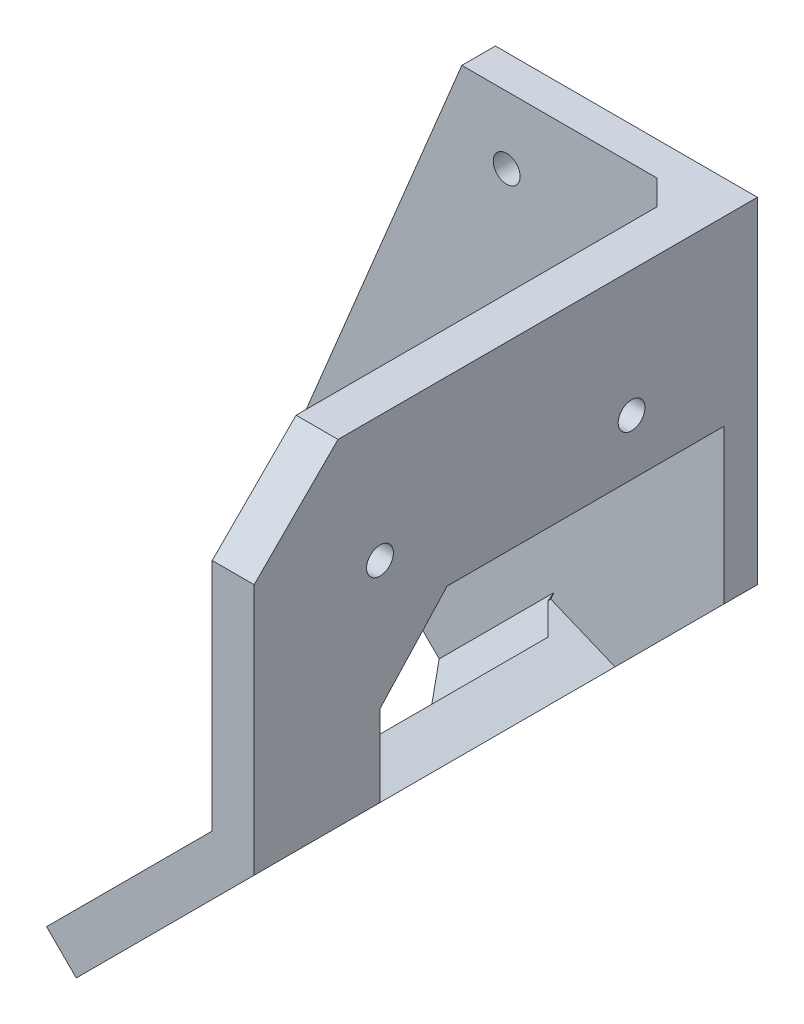
ISO-10303-21;
HEADER;
FILE_DESCRIPTION(('STEP AP214'),'2;1');
FILE_NAME('part.step','',(''),(''),'','','');
FILE_SCHEMA(('AUTOMOTIVE_DESIGN { 1 0 10303 214 1 1 1 1 }'));
ENDSEC;
DATA;
#1=APPLICATION_CONTEXT('core data for automotive mechanical design processes');
#2=APPLICATION_PROTOCOL_DEFINITION('international standard','automotive_design',2000,#1);
#3=PRODUCT_CONTEXT('',#1,'mechanical');
#4=PRODUCT('Part','Part','',(#3));
#5=PRODUCT_RELATED_PRODUCT_CATEGORY('part','',(#4));
#6=PRODUCT_DEFINITION_FORMATION('','',#4);
#7=PRODUCT_DEFINITION_CONTEXT('part definition',#1,'design');
#8=PRODUCT_DEFINITION('design','',#6,#7);
#9=PRODUCT_DEFINITION_SHAPE('','',#8);
#10=(LENGTH_UNIT() NAMED_UNIT(*) SI_UNIT(.MILLI.,.METRE.));
#11=(NAMED_UNIT(*) PLANE_ANGLE_UNIT() SI_UNIT($,.RADIAN.));
#12=(NAMED_UNIT(*) SI_UNIT($,.STERADIAN.) SOLID_ANGLE_UNIT());
#13=UNCERTAINTY_MEASURE_WITH_UNIT(LENGTH_MEASURE(1.E-05),#10,'distance_accuracy_value','');
#14=(GEOMETRIC_REPRESENTATION_CONTEXT(3) GLOBAL_UNCERTAINTY_ASSIGNED_CONTEXT((#13)) GLOBAL_UNIT_ASSIGNED_CONTEXT((#10,
#11,#12)) REPRESENTATION_CONTEXT('',''));
#15=CARTESIAN_POINT('',(0.,0.,0.));
#16=DIRECTION('',(0.,0.,1.));
#17=DIRECTION('',(1.,0.,0.));
#18=AXIS2_PLACEMENT_3D('',#15,#16,#17);
#19=CARTESIAN_POINT('',(196.715728752538,-203.284271247462,60.));
#20=DIRECTION('',(-0.707106781186552,0.707106781186543,0.));
#21=DIRECTION('',(-0.707106781186543,-0.707106781186552,0.));
#22=AXIS2_PLACEMENT_3D('',#19,#20,#21);
#23=PLANE('',#22);
#24=CARTESIAN_POINT('',(207.322330470336,-192.677669529663,15.));
#25=DIRECTION('',(0.707106781186551,-0.707106781186544,0.));
#26=DIRECTION('',(0.707106781186544,0.707106781186551,0.));
#27=AXIS2_PLACEMENT_3D('',#24,#25,#26);
#28=CIRCLE('',#27,1.6);
#29=CARTESIAN_POINT('',(208.453701320235,-191.546298679765,15.));
#30=VERTEX_POINT('',#29);
#31=EDGE_CURVE('E238',#30,#30,#28,.T.);
#32=ORIENTED_EDGE('',*,*,#31,.F.);
#33=EDGE_LOOP('',(#32));
#34=FACE_BOUND('',#33,.T.);
#35=CARTESIAN_POINT('',(207.322330470336,-192.677669529663,45.));
#36=DIRECTION('',(0.707106781186551,-0.707106781186544,0.));
#37=DIRECTION('',(0.707106781186544,0.707106781186551,0.));
#38=AXIS2_PLACEMENT_3D('',#35,#36,#37);
#39=CIRCLE('',#38,1.6);
#40=CARTESIAN_POINT('',(208.453701320235,-191.546298679765,45.));
#41=VERTEX_POINT('',#40);
#42=EDGE_CURVE('E239',#41,#41,#39,.T.);
#43=ORIENTED_EDGE('',*,*,#42,.F.);
#44=EDGE_LOOP('',(#43));
#45=FACE_BOUND('',#44,.T.);
#46=DIRECTION('',(-0.707106781186543,-0.707106781186552,0.));
#47=VECTOR('',#46,1.);
#48=CARTESIAN_POINT('',(196.715728752538,-203.284271247462,45.));
#49=LINE('',#48,#47);
#50=CARTESIAN_POINT('',(225.,-174.999999999999,45.));
#51=VERTEX_POINT('',#50);
#52=CARTESIAN_POINT('',(218.146000964983,-181.853999035016,45.));
#53=VERTEX_POINT('',#52);
#54=EDGE_CURVE('E234',#51,#53,#49,.T.);
#55=ORIENTED_EDGE('',*,*,#54,.F.);
#56=DIRECTION('',(0.,0.,-1.));
#57=VECTOR('',#56,1.);
#58=CARTESIAN_POINT('',(225.,-174.999999999999,60.));
#59=LINE('',#58,#57);
#60=CARTESIAN_POINT('',(225.,-174.999999999999,60.));
#61=VERTEX_POINT('',#60);
#62=EDGE_CURVE('E323',#61,#51,#59,.T.);
#63=ORIENTED_EDGE('',*,*,#62,.F.);
#64=DIRECTION('',(0.707106781186543,0.707106781186552,0.));
#65=VECTOR('',#64,1.);
#66=CARTESIAN_POINT('',(196.715728752538,-203.284271247462,60.));
#67=LINE('',#66,#65);
#68=CARTESIAN_POINT('',(203.786796564404,-196.213203435596,60.));
#69=VERTEX_POINT('',#68);
#70=EDGE_CURVE('E290',#69,#61,#67,.T.);
#71=ORIENTED_EDGE('',*,*,#70,.F.);
#72=DIRECTION('',(-0.499999999999997,-0.500000000000003,-0.707106781186548));
#73=VECTOR('',#72,1.);
#74=CARTESIAN_POINT('',(203.786796564403,-196.213203435596,59.9999999999997));
#75=LINE('',#74,#73);
#76=CARTESIAN_POINT('',(196.715728752538,-203.284271247462,50.));
#77=VERTEX_POINT('',#76);
#78=EDGE_CURVE('E359',#69,#77,#75,.T.);
#79=ORIENTED_EDGE('',*,*,#78,.T.);
#80=DIRECTION('',(0.,0.,-1.));
#81=VECTOR('',#80,1.);
#82=CARTESIAN_POINT('',(196.715728752538,-203.284271247462,60.));
#83=LINE('',#82,#81);
#84=CARTESIAN_POINT('',(196.715728752538,-203.284271247462,0.));
#85=VERTEX_POINT('',#84);
#86=EDGE_CURVE('E301',#77,#85,#83,.T.);
#87=ORIENTED_EDGE('',*,*,#86,.T.);
#88=DIRECTION('',(0.707106781186543,0.707106781186552,0.));
#89=VECTOR('',#88,1.);
#90=CARTESIAN_POINT('',(196.715728752538,-203.284271247462,0.));
#91=LINE('',#90,#89);
#92=CARTESIAN_POINT('',(225.,-174.999999999999,0.));
#93=VERTEX_POINT('',#92);
#94=EDGE_CURVE('E287',#85,#93,#91,.T.);
#95=ORIENTED_EDGE('',*,*,#94,.T.);
#96=CARTESIAN_POINT('',(225.,-174.999999999999,4.));
#97=VERTEX_POINT('',#96);
#98=EDGE_CURVE('E322',#97,#93,#59,.T.);
#99=ORIENTED_EDGE('',*,*,#98,.F.);
#100=DIRECTION('',(0.707106781186543,0.707106781186552,0.));
#101=VECTOR('',#100,1.);
#102=CARTESIAN_POINT('',(196.715728752538,-203.284271247462,4.));
#103=LINE('',#102,#101);
#104=CARTESIAN_POINT('',(212.023066047142,-187.976933952858,4.));
#105=VERTEX_POINT('',#104);
#106=EDGE_CURVE('E50',#105,#97,#103,.T.);
#107=ORIENTED_EDGE('',*,*,#106,.F.);
#108=DIRECTION('',(0.,0.,-1.));
#109=VECTOR('',#108,1.);
#110=CARTESIAN_POINT('',(212.023066047142,-187.976933952858,60.));
#111=LINE('',#110,#109);
#112=CARTESIAN_POINT('',(212.023066047142,-187.976933952858,37.));
#113=VERTEX_POINT('',#112);
#114=EDGE_CURVE('E184',#113,#105,#111,.T.);
#115=ORIENTED_EDGE('',*,*,#114,.F.);
#116=DIRECTION('',(-0.51937668737614,-0.519376687376146,-0.67859834454585));
#117=VECTOR('',#116,1.);
#118=CARTESIAN_POINT('',(211.870999643252,-188.129000356748,36.8013156684757));
#119=LINE('',#118,#117);
#120=EDGE_CURVE('E228',#53,#113,#119,.T.);
#121=ORIENTED_EDGE('',*,*,#120,.F.);
#122=EDGE_LOOP('',(#55,#63,#71,#79,#87,#95,#99,#107,#115,#121));
#123=FACE_BOUND('',#122,.T.);
#124=ADVANCED_FACE('F35',(#34,#45,#123),#23,.F.);
#125=CARTESIAN_POINT('',(225.,-174.999999999999,60.));
#126=DIRECTION('',(-1.,0.,0.));
#127=DIRECTION('',(0.,0.,1.));
#128=AXIS2_PLACEMENT_3D('',#125,#126,#127);
#129=PLANE('',#128);
#130=CARTESIAN_POINT('',(225.,-150.,15.));
#131=DIRECTION('',(1.,0.,0.));
#132=DIRECTION('',(0.,0.,-1.));
#133=AXIS2_PLACEMENT_3D('',#130,#131,#132);
#134=CIRCLE('',#133,1.6);
#135=CARTESIAN_POINT('',(225.,-150.,13.4));
#136=VERTEX_POINT('',#135);
#137=EDGE_CURVE('E249',#136,#136,#134,.T.);
#138=ORIENTED_EDGE('',*,*,#137,.F.);
#139=EDGE_LOOP('',(#138));
#140=FACE_BOUND('',#139,.T.);
#141=CARTESIAN_POINT('',(225.,-149.999999999999,45.));
#142=DIRECTION('',(1.,0.,0.));
#143=DIRECTION('',(0.,0.,-1.));
#144=AXIS2_PLACEMENT_3D('',#141,#142,#143);
#145=CIRCLE('',#144,1.6);
#146=CARTESIAN_POINT('',(225.,-149.999999999999,43.4));
#147=VERTEX_POINT('',#146);
#148=EDGE_CURVE('E245',#147,#147,#145,.T.);
#149=ORIENTED_EDGE('',*,*,#148,.F.);
#150=EDGE_LOOP('',(#149));
#151=FACE_BOUND('',#150,.T.);
#152=DIRECTION('',(0.,-1.,0.));
#153=VECTOR('',#152,1.);
#154=CARTESIAN_POINT('',(225.,-174.999999999999,45.));
#155=LINE('',#154,#153);
#156=CARTESIAN_POINT('',(225.,-165.306981608187,45.));
#157=VERTEX_POINT('',#156);
#158=EDGE_CURVE('E232',#157,#51,#155,.T.);
#159=ORIENTED_EDGE('',*,*,#158,.F.);
#160=DIRECTION('',(0.,-0.734509555267757,0.678598344545845));
#161=VECTOR('',#160,1.);
#162=CARTESIAN_POINT('',(225.,-178.012961106271,56.7387943987878));
#163=LINE('',#162,#161);
#164=CARTESIAN_POINT('',(225.,-156.647844005847,37.));
#165=VERTEX_POINT('',#164);
#166=EDGE_CURVE('E236',#165,#157,#163,.T.);
#167=ORIENTED_EDGE('',*,*,#166,.F.);
#168=DIRECTION('',(0.,0.,1.));
#169=VECTOR('',#168,1.);
#170=CARTESIAN_POINT('',(225.,-156.647844005847,60.));
#171=LINE('',#170,#169);
#172=CARTESIAN_POINT('',(225.,-156.647844005847,4.));
#173=VERTEX_POINT('',#172);
#174=EDGE_CURVE('E226',#173,#165,#171,.T.);
#175=ORIENTED_EDGE('',*,*,#174,.F.);
#176=DIRECTION('',(0.,1.,0.));
#177=VECTOR('',#176,1.);
#178=CARTESIAN_POINT('',(225.,-174.999999999999,4.));
#179=LINE('',#178,#177);
#180=EDGE_CURVE('E218',#97,#173,#179,.T.);
#181=ORIENTED_EDGE('',*,*,#180,.F.);
#182=ORIENTED_EDGE('',*,*,#98,.T.);
#183=DIRECTION('',(0.,1.,0.));
#184=VECTOR('',#183,1.);
#185=CARTESIAN_POINT('',(225.,-174.999999999999,0.));
#186=LINE('',#185,#184);
#187=CARTESIAN_POINT('',(225.,-134.999999999999,0.));
#188=VERTEX_POINT('',#187);
#189=EDGE_CURVE('E304',#93,#188,#186,.T.);
#190=ORIENTED_EDGE('',*,*,#189,.T.);
#191=DIRECTION('',(0.,0.,-1.));
#192=VECTOR('',#191,1.);
#193=CARTESIAN_POINT('',(225.,-134.999999999999,60.));
#194=LINE('',#193,#192);
#195=CARTESIAN_POINT('',(225.,-134.999999999999,50.));
#196=VERTEX_POINT('',#195);
#197=EDGE_CURVE('E320',#196,#188,#194,.T.);
#198=ORIENTED_EDGE('',*,*,#197,.F.);
#199=DIRECTION('',(0.,-0.707106781186547,0.707106781186548));
#200=VECTOR('',#199,1.);
#201=CARTESIAN_POINT('',(225.,-144.999999999999,60.));
#202=LINE('',#201,#200);
#203=CARTESIAN_POINT('',(225.,-144.999999999999,60.));
#204=VERTEX_POINT('',#203);
#205=EDGE_CURVE('E357',#196,#204,#202,.T.);
#206=ORIENTED_EDGE('',*,*,#205,.T.);
#207=DIRECTION('',(0.,1.,0.));
#208=VECTOR('',#207,1.);
#209=CARTESIAN_POINT('',(225.,-174.999999999999,60.));
#210=LINE('',#209,#208);
#211=EDGE_CURVE('E292',#61,#204,#210,.T.);
#212=ORIENTED_EDGE('',*,*,#211,.F.);
#213=ORIENTED_EDGE('',*,*,#62,.T.);
#214=EDGE_LOOP('',(#159,#167,#175,#181,#182,#190,#198,#206,#212,#213));
#215=FACE_BOUND('',#214,.T.);
#216=ADVANCED_FACE('F412',(#140,#151,#215),#129,.F.);
#217=CARTESIAN_POINT('',(220.,-134.999999999999,60.));
#218=DIRECTION('',(1.,0.,0.));
#219=DIRECTION('',(0.,0.,-1.));
#220=AXIS2_PLACEMENT_3D('',#217,#218,#219);
#221=PLANE('',#220);
#222=CARTESIAN_POINT('',(220.,-150.,15.));
#223=DIRECTION('',(1.,0.,0.));
#224=DIRECTION('',(0.,0.,-1.));
#225=AXIS2_PLACEMENT_3D('',#222,#223,#224);
#226=CIRCLE('',#225,1.6);
#227=CARTESIAN_POINT('',(220.,-150.,13.4));
#228=VERTEX_POINT('',#227);
#229=EDGE_CURVE('E248',#228,#228,#226,.T.);
#230=ORIENTED_EDGE('',*,*,#229,.T.);
#231=EDGE_LOOP('',(#230));
#232=FACE_BOUND('',#231,.T.);
#233=CARTESIAN_POINT('',(220.,-149.999999999999,45.));
#234=DIRECTION('',(1.,0.,0.));
#235=DIRECTION('',(0.,0.,-1.));
#236=AXIS2_PLACEMENT_3D('',#233,#234,#235);
#237=CIRCLE('',#236,1.6);
#238=CARTESIAN_POINT('',(220.,-149.999999999999,43.4));
#239=VERTEX_POINT('',#238);
#240=EDGE_CURVE('E260',#239,#239,#237,.T.);
#241=ORIENTED_EDGE('',*,*,#240,.T.);
#242=EDGE_LOOP('',(#241));
#243=FACE_BOUND('',#242,.T.);
#244=DIRECTION('',(0.,0.,-1.));
#245=VECTOR('',#244,1.);
#246=CARTESIAN_POINT('',(220.,-154.576776193982,60.));
#247=LINE('',#246,#245);
#248=CARTESIAN_POINT('',(220.,-154.576776193982,37.));
#249=VERTEX_POINT('',#248);
#250=CARTESIAN_POINT('',(220.,-154.576776193982,7.00000000000003));
#251=VERTEX_POINT('',#250);
#252=EDGE_CURVE('E224',#249,#251,#247,.T.);
#253=ORIENTED_EDGE('',*,*,#252,.F.);
#254=DIRECTION('',(0.,0.734509555267757,-0.678598344545845));
#255=VECTOR('',#254,1.);
#256=CARTESIAN_POINT('',(220.,-155.479071785932,37.8336124296782));
#257=LINE('',#256,#255);
#258=CARTESIAN_POINT('',(220.,-163.235913796321,45.));
#259=VERTEX_POINT('',#258);
#260=EDGE_CURVE('E11',#259,#249,#257,.T.);
#261=ORIENTED_EDGE('',*,*,#260,.F.);
#262=DIRECTION('',(0.,1.,0.));
#263=VECTOR('',#262,1.);
#264=CARTESIAN_POINT('',(220.,-134.999999999999,45.));
#265=LINE('',#264,#263);
#266=CARTESIAN_POINT('',(220.,-172.928932188134,45.));
#267=VERTEX_POINT('',#266);
#268=EDGE_CURVE('E230',#267,#259,#265,.T.);
#269=ORIENTED_EDGE('',*,*,#268,.F.);
#270=DIRECTION('',(0.,0.,-1.));
#271=VECTOR('',#270,1.);
#272=CARTESIAN_POINT('',(220.,-172.928932188134,60.));
#273=LINE('',#272,#271);
#274=CARTESIAN_POINT('',(220.,-172.928932188134,60.));
#275=VERTEX_POINT('',#274);
#276=EDGE_CURVE('E315',#275,#267,#273,.T.);
#277=ORIENTED_EDGE('',*,*,#276,.F.);
#278=DIRECTION('',(0.,-1.,0.));
#279=VECTOR('',#278,1.);
#280=CARTESIAN_POINT('',(220.,-134.999999999999,60.));
#281=LINE('',#280,#279);
#282=CARTESIAN_POINT('',(220.,-144.999999999999,60.));
#283=VERTEX_POINT('',#282);
#284=EDGE_CURVE('E296',#283,#275,#281,.T.);
#285=ORIENTED_EDGE('',*,*,#284,.F.);
#286=DIRECTION('',(0.,0.707106781186547,-0.707106781186548));
#287=VECTOR('',#286,1.);
#288=CARTESIAN_POINT('',(220.,-144.999999999999,60.));
#289=LINE('',#288,#287);
#290=CARTESIAN_POINT('',(220.,-134.999999999999,50.));
#291=VERTEX_POINT('',#290);
#292=EDGE_CURVE('E353',#283,#291,#289,.T.);
#293=ORIENTED_EDGE('',*,*,#292,.T.);
#294=DIRECTION('',(0.,0.,-1.));
#295=VECTOR('',#294,1.);
#296=CARTESIAN_POINT('',(220.,-134.999999999999,60.));
#297=LINE('',#296,#295);
#298=CARTESIAN_POINT('',(220.,-134.999999999999,7.00000000000003));
#299=VERTEX_POINT('',#298);
#300=EDGE_CURVE('E318',#291,#299,#297,.T.);
#301=ORIENTED_EDGE('',*,*,#300,.T.);
#302=DIRECTION('',(0.,-1.,0.));
#303=VECTOR('',#302,1.);
#304=CARTESIAN_POINT('',(220.,-134.999999999999,7.00000000000003));
#305=LINE('',#304,#303);
#306=EDGE_CURVE('E331',#299,#251,#305,.T.);
#307=ORIENTED_EDGE('',*,*,#306,.T.);
#308=EDGE_LOOP('',(#253,#261,#269,#277,#285,#293,#301,#307));
#309=FACE_BOUND('',#308,.T.);
#310=ADVANCED_FACE('F383',(#232,#243,#309),#221,.F.);
#311=CARTESIAN_POINT('',(220.,-172.928932188134,60.));
#312=DIRECTION('',(0.707106781186547,-0.707106781186547,0.));
#313=DIRECTION('',(0.707106781186548,0.707106781186548,0.));
#314=AXIS2_PLACEMENT_3D('',#311,#312,#313);
#315=PLANE('',#314);
#316=CARTESIAN_POINT('',(203.786796564404,-189.14213562373,15.));
#317=DIRECTION('',(0.707106781186547,-0.707106781186547,0.));
#318=DIRECTION('',(0.707106781186548,0.707106781186548,0.));
#319=AXIS2_PLACEMENT_3D('',#316,#317,#318);
#320=CIRCLE('',#319,1.6);
#321=CARTESIAN_POINT('',(204.918167414302,-188.010764773832,15.));
#322=VERTEX_POINT('',#321);
#323=EDGE_CURVE('E242',#322,#322,#320,.T.);
#324=ORIENTED_EDGE('',*,*,#323,.T.);
#325=EDGE_LOOP('',(#324));
#326=FACE_BOUND('',#325,.T.);
#327=CARTESIAN_POINT('',(203.786796564404,-189.14213562373,45.));
#328=DIRECTION('',(0.707106781186547,-0.707106781186547,0.));
#329=DIRECTION('',(0.707106781186548,0.707106781186548,0.));
#330=AXIS2_PLACEMENT_3D('',#327,#328,#329);
#331=CIRCLE('',#330,1.6);
#332=CARTESIAN_POINT('',(204.918167414302,-188.010764773832,45.));
#333=VERTEX_POINT('',#332);
#334=EDGE_CURVE('E252',#333,#333,#331,.T.);
#335=ORIENTED_EDGE('',*,*,#334,.T.);
#336=EDGE_LOOP('',(#335));
#337=FACE_BOUND('',#336,.T.);
#338=DIRECTION('',(0.707106781186548,0.707106781186548,0.));
#339=VECTOR('',#338,1.);
#340=CARTESIAN_POINT('',(220.,-172.928932188134,45.));
#341=LINE('',#340,#339);
#342=CARTESIAN_POINT('',(213.146000964983,-179.782931223151,45.));
#343=VERTEX_POINT('',#342);
#344=EDGE_CURVE('E43',#343,#267,#341,.T.);
#345=ORIENTED_EDGE('',*,*,#344,.F.);
#346=DIRECTION('',(0.519376687376144,0.519376687376144,0.678598344545849));
#347=VECTOR('',#346,1.);
#348=CARTESIAN_POINT('',(222.130485229696,-170.798446958438,56.7387943987879));
#349=LINE('',#348,#347);
#350=CARTESIAN_POINT('',(207.023066047142,-185.905866140992,37.));
#351=VERTEX_POINT('',#350);
#352=EDGE_CURVE('E370',#351,#343,#349,.T.);
#353=ORIENTED_EDGE('',*,*,#352,.F.);
#354=DIRECTION('',(0.,0.,1.));
#355=VECTOR('',#354,1.);
#356=CARTESIAN_POINT('',(207.023066047142,-185.905866140992,60.));
#357=LINE('',#356,#355);
#358=CARTESIAN_POINT('',(207.023066047142,-185.905866140992,7.00000000000003));
#359=VERTEX_POINT('',#358);
#360=EDGE_CURVE('E221',#359,#351,#357,.T.);
#361=ORIENTED_EDGE('',*,*,#360,.F.);
#362=DIRECTION('',(-0.707106781186548,-0.707106781186548,0.));
#363=VECTOR('',#362,1.);
#364=CARTESIAN_POINT('',(220.,-172.928932188134,7.00000000000003));
#365=LINE('',#364,#363);
#366=CARTESIAN_POINT('',(193.180194846605,-199.748737341529,7.00000000000003));
#367=VERTEX_POINT('',#366);
#368=EDGE_CURVE('E326',#359,#367,#365,.T.);
#369=ORIENTED_EDGE('',*,*,#368,.T.);
#370=DIRECTION('',(0.,0.,-1.));
#371=VECTOR('',#370,1.);
#372=CARTESIAN_POINT('',(193.180194846605,-199.748737341529,60.));
#373=LINE('',#372,#371);
#374=CARTESIAN_POINT('',(193.180194846605,-199.748737341529,50.));
#375=VERTEX_POINT('',#374);
#376=EDGE_CURVE('E312',#375,#367,#373,.T.);
#377=ORIENTED_EDGE('',*,*,#376,.F.);
#378=DIRECTION('',(0.5,0.5,0.707106781186548));
#379=VECTOR('',#378,1.);
#380=CARTESIAN_POINT('',(200.25126265847,-192.677669529664,59.9999999999989));
#381=LINE('',#380,#379);
#382=CARTESIAN_POINT('',(200.251262658471,-192.677669529663,60.));
#383=VERTEX_POINT('',#382);
#384=EDGE_CURVE('E363',#375,#383,#381,.T.);
#385=ORIENTED_EDGE('',*,*,#384,.T.);
#386=DIRECTION('',(-0.707106781186548,-0.707106781186548,0.));
#387=VECTOR('',#386,1.);
#388=CARTESIAN_POINT('',(220.,-172.928932188134,60.));
#389=LINE('',#388,#387);
#390=EDGE_CURVE('E298',#275,#383,#389,.T.);
#391=ORIENTED_EDGE('',*,*,#390,.F.);
#392=ORIENTED_EDGE('',*,*,#276,.T.);
#393=EDGE_LOOP('',(#345,#353,#361,#369,#377,#385,#391,#392));
#394=FACE_BOUND('',#393,.T.);
#395=ADVANCED_FACE('F386',(#326,#337,#394),#315,.F.);
#396=CARTESIAN_POINT('',(220.,-134.999999999999,7.00000000000003));
#397=DIRECTION('',(0.707106781186551,0.,-0.707106781186544));
#398=DIRECTION('',(0.,-1.,0.));
#399=AXIS2_PLACEMENT_3D('',#396,#397,#398);
#400=PLANE('',#399);
#401=DIRECTION('',(-0.678598344545844,0.281084637714817,-0.678598344545851));
#402=VECTOR('',#401,1.);
#403=CARTESIAN_POINT('',(216.265855822986,-153.030043032006,3.2658558229862));
#404=LINE('',#403,#402);
#405=CARTESIAN_POINT('',(217.346331352698,-153.477590650225,4.34633135269842));
#406=VERTEX_POINT('',#405);
#407=EDGE_CURVE('E368',#251,#406,#404,.T.);
#408=ORIENTED_EDGE('',*,*,#407,.F.);
#409=ORIENTED_EDGE('',*,*,#306,.F.);
#410=DIRECTION('',(0.707106781186544,0.,0.707106781186551));
#411=VECTOR('',#410,1.);
#412=CARTESIAN_POINT('',(246.5,-134.999999999999,33.5000000000003));
#413=LINE('',#412,#411);
#414=CARTESIAN_POINT('',(217.,-134.999999999999,4.));
#415=VERTEX_POINT('',#414);
#416=EDGE_CURVE('E336',#415,#299,#413,.T.);
#417=ORIENTED_EDGE('',*,*,#416,.F.);
#418=DIRECTION('',(0.,1.,0.));
#419=VECTOR('',#418,1.);
#420=CARTESIAN_POINT('',(217.,0.,4.));
#421=LINE('',#420,#419);
#422=CARTESIAN_POINT('',(217.,-154.313708498985,3.99999999999999));
#423=VERTEX_POINT('',#422);
#424=EDGE_CURVE('E328',#423,#415,#421,.T.);
#425=ORIENTED_EDGE('',*,*,#424,.F.);
#426=DIRECTION('',(-0.357406744336591,-0.862856209461018,-0.357406744336594));
#427=VECTOR('',#426,1.);
#428=CARTESIAN_POINT('',(223.722604191027,-138.08390628654,10.7226041910274));
#429=LINE('',#428,#427);
#430=EDGE_CURVE('E216',#406,#423,#429,.T.);
#431=ORIENTED_EDGE('',*,*,#430,.F.);
#432=EDGE_LOOP('',(#408,#409,#417,#425,#431));
#433=FACE_BOUND('',#432,.T.);
#434=ADVANCED_FACE('F428',(#433),#400,.F.);
#435=CARTESIAN_POINT('',(220.,-172.928932188134,7.00000000000003));
#436=DIRECTION('',(0.500000000000007,-0.500000000000007,-0.707106781186538));
#437=DIRECTION('',(-0.707106781186548,-0.707106781186548,0.));
#438=AXIS2_PLACEMENT_3D('',#435,#436,#437);
#439=PLANE('',#438);
#440=DIRECTION('',(0.67859834454584,-0.281084637714815,0.678598344545857));
#441=VECTOR('',#440,1.);
#442=CARTESIAN_POINT('',(210.523621795553,-187.355843807828,10.5005557484117));
#443=LINE('',#442,#441);
#444=CARTESIAN_POINT('',(204.36939739984,-184.806680597236,4.34633135269849));
#445=VERTEX_POINT('',#444);
#446=EDGE_CURVE('E366',#445,#359,#443,.T.);
#447=ORIENTED_EDGE('',*,*,#446,.F.);
#448=DIRECTION('',(-0.357406744336589,-0.862856209461014,0.357406744336604));
#449=VECTOR('',#448,1.);
#450=CARTESIAN_POINT('',(209.690051803188,-171.961484575974,-0.974323050649328));
#451=LINE('',#450,#449);
#452=CARTESIAN_POINT('',(204.715728752539,-183.970562748476,4.));
#453=VERTEX_POINT('',#452);
#454=EDGE_CURVE('E189',#453,#445,#451,.T.);
#455=ORIENTED_EDGE('',*,*,#454,.F.);
#456=DIRECTION('',(0.707106781186548,0.707106781186548,0.));
#457=VECTOR('',#456,1.);
#458=CARTESIAN_POINT('',(194.343145750507,-194.343145750507,4.));
#459=LINE('',#458,#457);
#460=CARTESIAN_POINT('',(191.058874503046,-197.627416997969,4.));
#461=VERTEX_POINT('',#460);
#462=EDGE_CURVE('E199',#461,#453,#459,.T.);
#463=ORIENTED_EDGE('',*,*,#462,.F.);
#464=DIRECTION('',(-0.499999999999997,0.499999999999989,-0.707106781186557));
#465=VECTOR('',#464,1.);
#466=CARTESIAN_POINT('',(213.686291501015,-220.254833995938,36.0000000000009));
#467=LINE('',#466,#465);
#468=EDGE_CURVE('E334',#367,#461,#467,.T.);
#469=ORIENTED_EDGE('',*,*,#468,.F.);
#470=ORIENTED_EDGE('',*,*,#368,.F.);
#471=EDGE_LOOP('',(#447,#455,#463,#469,#470));
#472=FACE_BOUND('',#471,.T.);
#473=ADVANCED_FACE('F440',(#472),#439,.F.);
#474=CARTESIAN_POINT('',(220.,-134.999999999999,60.));
#475=DIRECTION('',(0.,-1.,0.));
#476=DIRECTION('',(0.,0.,-1.));
#477=AXIS2_PLACEMENT_3D('',#474,#475,#476);
#478=PLANE('',#477);
#479=ORIENTED_EDGE('',*,*,#300,.F.);
#480=DIRECTION('',(1.,0.,0.));
#481=VECTOR('',#480,1.);
#482=CARTESIAN_POINT('',(225.,-134.999999999999,50.));
#483=LINE('',#482,#481);
#484=EDGE_CURVE('E355',#291,#196,#483,.T.);
#485=ORIENTED_EDGE('',*,*,#484,.T.);
#486=ORIENTED_EDGE('',*,*,#197,.T.);
#487=DIRECTION('',(-1.,0.,0.));
#488=VECTOR('',#487,1.);
#489=CARTESIAN_POINT('',(220.,-134.999999999999,0.));
#490=LINE('',#489,#488);
#491=CARTESIAN_POINT('',(193.759605748895,-134.999999999999,0.));
#492=VERTEX_POINT('',#491);
#493=EDGE_CURVE('E307',#188,#492,#490,.T.);
#494=ORIENTED_EDGE('',*,*,#493,.T.);
#495=DIRECTION('',(0.,0.,-1.));
#496=VECTOR('',#495,1.);
#497=CARTESIAN_POINT('',(193.759605748895,-134.999999999999,4.));
#498=LINE('',#497,#496);
#499=CARTESIAN_POINT('',(193.759605748895,-134.999999999999,4.));
#500=VERTEX_POINT('',#499);
#501=EDGE_CURVE('E284',#500,#492,#498,.T.);
#502=ORIENTED_EDGE('',*,*,#501,.F.);
#503=DIRECTION('',(1.,0.,0.));
#504=VECTOR('',#503,1.);
#505=CARTESIAN_POINT('',(225.,-134.999999999999,4.));
#506=LINE('',#505,#504);
#507=EDGE_CURVE('E278',#500,#415,#506,.T.);
#508=ORIENTED_EDGE('',*,*,#507,.T.);
#509=ORIENTED_EDGE('',*,*,#416,.T.);
#510=EDGE_LOOP('',(#479,#485,#486,#494,#502,#508,#509));
#511=FACE_BOUND('',#510,.T.);
#512=ADVANCED_FACE('F435',(#511),#478,.F.);
#513=CARTESIAN_POINT('',(196.715728752538,-203.284271247462,60.));
#514=DIRECTION('',(0.707106781186542,0.707106781186553,0.));
#515=DIRECTION('',(-0.707106781186553,0.707106781186542,0.));
#516=AXIS2_PLACEMENT_3D('',#513,#514,#515);
#517=PLANE('',#516);
#518=ORIENTED_EDGE('',*,*,#86,.F.);
#519=DIRECTION('',(-0.707106781186553,0.707106781186542,0.));
#520=VECTOR('',#519,1.);
#521=CARTESIAN_POINT('',(193.180194846605,-199.748737341529,50.));
#522=LINE('',#521,#520);
#523=EDGE_CURVE('E361',#77,#375,#522,.T.);
#524=ORIENTED_EDGE('',*,*,#523,.T.);
#525=ORIENTED_EDGE('',*,*,#376,.T.);
#526=ORIENTED_EDGE('',*,*,#468,.T.);
#527=DIRECTION('',(-0.707106781186553,0.707106781186542,0.));
#528=VECTOR('',#527,1.);
#529=CARTESIAN_POINT('',(174.62543413064,-181.193976625564,4.));
#530=LINE('',#529,#528);
#531=CARTESIAN_POINT('',(174.62543413064,-181.193976625564,4.));
#532=VERTEX_POINT('',#531);
#533=EDGE_CURVE('E273',#461,#532,#530,.T.);
#534=ORIENTED_EDGE('',*,*,#533,.T.);
#535=DIRECTION('',(0.,0.,-1.));
#536=VECTOR('',#535,1.);
#537=CARTESIAN_POINT('',(174.62543413064,-181.193976625564,4.));
#538=LINE('',#537,#536);
#539=CARTESIAN_POINT('',(174.62543413064,-181.193976625564,0.));
#540=VERTEX_POINT('',#539);
#541=EDGE_CURVE('E281',#532,#540,#538,.T.);
#542=ORIENTED_EDGE('',*,*,#541,.T.);
#543=DIRECTION('',(0.707106781186553,-0.707106781186542,0.));
#544=VECTOR('',#543,1.);
#545=CARTESIAN_POINT('',(196.715728752538,-203.284271247462,0.));
#546=LINE('',#545,#544);
#547=EDGE_CURVE('E293',#540,#85,#546,.T.);
#548=ORIENTED_EDGE('',*,*,#547,.T.);
#549=EDGE_LOOP('',(#518,#524,#525,#526,#534,#542,#548));
#550=FACE_BOUND('',#549,.T.);
#551=ADVANCED_FACE('F400',(#550),#517,.F.);
#552=CARTESIAN_POINT('',(0.,0.,60.));
#553=DIRECTION('',(0.,0.,1.));
#554=DIRECTION('',(1.,0.,0.));
#555=AXIS2_PLACEMENT_3D('',#552,#553,#554);
#556=PLANE('',#555);
#557=ORIENTED_EDGE('',*,*,#211,.T.);
#558=DIRECTION('',(-1.,0.,0.));
#559=VECTOR('',#558,1.);
#560=CARTESIAN_POINT('',(220.,-144.999999999999,60.));
#561=LINE('',#560,#559);
#562=EDGE_CURVE('E350',#204,#283,#561,.T.);
#563=ORIENTED_EDGE('',*,*,#562,.T.);
#564=ORIENTED_EDGE('',*,*,#284,.T.);
#565=ORIENTED_EDGE('',*,*,#390,.T.);
#566=DIRECTION('',(0.707106781186553,-0.707106781186542,0.));
#567=VECTOR('',#566,1.);
#568=CARTESIAN_POINT('',(203.786796564404,-196.213203435596,60.));
#569=LINE('',#568,#567);
#570=EDGE_CURVE('E339',#383,#69,#569,.T.);
#571=ORIENTED_EDGE('',*,*,#570,.T.);
#572=ORIENTED_EDGE('',*,*,#70,.T.);
#573=EDGE_LOOP('',(#557,#563,#564,#565,#571,#572));
#574=FACE_BOUND('',#573,.T.);
#575=ADVANCED_FACE('F391',(#574),#556,.T.);
#576=CARTESIAN_POINT('',(0.,0.,0.));
#577=DIRECTION('',(0.,0.,1.));
#578=DIRECTION('',(1.,0.,0.));
#579=AXIS2_PLACEMENT_3D('',#576,#577,#578);
#580=PLANE('',#579);
#581=ORIENTED_EDGE('',*,*,#94,.F.);
#582=ORIENTED_EDGE('',*,*,#547,.F.);
#583=DIRECTION('',(0.382683432365087,0.923879532511288,0.));
#584=VECTOR('',#583,1.);
#585=CARTESIAN_POINT('',(193.759605748895,-134.999999999999,0.));
#586=LINE('',#585,#584);
#587=EDGE_CURVE('E270',#540,#492,#586,.T.);
#588=ORIENTED_EDGE('',*,*,#587,.T.);
#589=ORIENTED_EDGE('',*,*,#493,.F.);
#590=ORIENTED_EDGE('',*,*,#189,.F.);
#591=EDGE_LOOP('',(#581,#582,#588,#589,#590));
#592=FACE_BOUND('',#591,.T.);
#593=CARTESIAN_POINT('',(199.10503485225,-143.,0.));
#594=DIRECTION('',(0.,0.,-1.));
#595=DIRECTION('',(-1.,0.,0.));
#596=AXIS2_PLACEMENT_3D('',#593,#594,#595);
#597=CIRCLE('',#596,1.59999999999999);
#598=CARTESIAN_POINT('',(197.50503485225,-143.,0.));
#599=VERTEX_POINT('',#598);
#600=EDGE_CURVE('E257',#599,#599,#597,.T.);
#601=ORIENTED_EDGE('',*,*,#600,.F.);
#602=EDGE_LOOP('',(#601));
#603=FACE_BOUND('',#602,.T.);
#604=CARTESIAN_POINT('',(184.062077547467,-179.316911543406,0.));
#605=DIRECTION('',(0.,0.,-1.));
#606=DIRECTION('',(-1.,0.,0.));
#607=AXIS2_PLACEMENT_3D('',#604,#605,#606);
#608=CIRCLE('',#607,1.59999999999999);
#609=CARTESIAN_POINT('',(182.462077547467,-179.316911543406,0.));
#610=VERTEX_POINT('',#609);
#611=EDGE_CURVE('E256',#610,#610,#608,.T.);
#612=ORIENTED_EDGE('',*,*,#611,.F.);
#613=EDGE_LOOP('',(#612));
#614=FACE_BOUND('',#613,.T.);
#615=CARTESIAN_POINT('',(207.28950825255,-167.664074121909,0.));
#616=DIRECTION('',(0.,0.,-1.));
#617=DIRECTION('',(-1.,0.,0.));
#618=AXIS2_PLACEMENT_3D('',#615,#616,#617);
#619=CIRCLE('',#618,1.59999999999999);
#620=CARTESIAN_POINT('',(205.68950825255,-167.664074121909,0.));
#621=VERTEX_POINT('',#620);
#622=EDGE_CURVE('E264',#621,#621,#619,.T.);
#623=ORIENTED_EDGE('',*,*,#622,.F.);
#624=EDGE_LOOP('',(#623));
#625=FACE_BOUND('',#624,.T.);
#626=ADVANCED_FACE('F406',(#592,#603,#614,#625),#580,.F.);
#627=CARTESIAN_POINT('',(0.,0.,4.));
#628=DIRECTION('',(0.,0.,1.));
#629=DIRECTION('',(1.,0.,0.));
#630=AXIS2_PLACEMENT_3D('',#627,#628,#629);
#631=PLANE('',#630);
#632=DIRECTION('',(0.382683432365087,0.923879532511288,0.));
#633=VECTOR('',#632,1.);
#634=CARTESIAN_POINT('',(204.36939739984,-184.806680597236,4.));
#635=LINE('',#634,#633);
#636=CARTESIAN_POINT('',(217.346331352698,-153.477590650225,4.));
#637=VERTEX_POINT('',#636);
#638=EDGE_CURVE('E190',#423,#637,#635,.T.);
#639=ORIENTED_EDGE('',*,*,#638,.F.);
#640=ORIENTED_EDGE('',*,*,#424,.T.);
#641=ORIENTED_EDGE('',*,*,#507,.F.);
#642=DIRECTION('',(0.382683432365087,0.923879532511288,0.));
#643=VECTOR('',#642,1.);
#644=CARTESIAN_POINT('',(193.759605748895,-134.999999999999,4.));
#645=LINE('',#644,#643);
#646=EDGE_CURVE('E275',#532,#500,#645,.T.);
#647=ORIENTED_EDGE('',*,*,#646,.F.);
#648=ORIENTED_EDGE('',*,*,#533,.F.);
#649=ORIENTED_EDGE('',*,*,#462,.T.);
#650=CARTESIAN_POINT('',(204.36939739984,-184.806680597236,4.));
#651=VERTEX_POINT('',#650);
#652=EDGE_CURVE('E58',#651,#453,#635,.T.);
#653=ORIENTED_EDGE('',*,*,#652,.F.);
#654=DIRECTION('',(-0.923879532511288,0.382683432365087,0.));
#655=VECTOR('',#654,1.);
#656=CARTESIAN_POINT('',(241.324578700292,-200.114017891839,4.));
#657=LINE('',#656,#655);
#658=EDGE_CURVE('E178',#105,#651,#657,.T.);
#659=ORIENTED_EDGE('',*,*,#658,.F.);
#660=ORIENTED_EDGE('',*,*,#106,.T.);
#661=ORIENTED_EDGE('',*,*,#180,.T.);
#662=DIRECTION('',(-0.923879532511288,0.382683432365087,0.));
#663=VECTOR('',#662,1.);
#664=CARTESIAN_POINT('',(254.30151265315,-168.784927944829,4.));
#665=LINE('',#664,#663);
#666=EDGE_CURVE('E186',#173,#637,#665,.T.);
#667=ORIENTED_EDGE('',*,*,#666,.T.);
#668=EDGE_LOOP('',(#639,#640,#641,#647,#648,#649,#653,#659,#660,#661,#667));
#669=FACE_BOUND('',#668,.T.);
#670=CARTESIAN_POINT('',(207.28950825255,-167.664074121909,4.));
#671=DIRECTION('',(0.,0.,-1.));
#672=DIRECTION('',(-1.,0.,0.));
#673=AXIS2_PLACEMENT_3D('',#670,#671,#672);
#674=CIRCLE('',#673,1.59999999999999);
#675=CARTESIAN_POINT('',(205.68950825255,-167.664074121909,4.));
#676=VERTEX_POINT('',#675);
#677=EDGE_CURVE('E267',#676,#676,#674,.T.);
#678=ORIENTED_EDGE('',*,*,#677,.T.);
#679=EDGE_LOOP('',(#678));
#680=FACE_BOUND('',#679,.T.);
#681=CARTESIAN_POINT('',(184.062077547467,-179.316911543406,4.));
#682=DIRECTION('',(0.,0.,-1.));
#683=DIRECTION('',(-1.,0.,0.));
#684=AXIS2_PLACEMENT_3D('',#681,#682,#683);
#685=CIRCLE('',#684,1.59999999999999);
#686=CARTESIAN_POINT('',(182.462077547467,-179.316911543406,4.));
#687=VERTEX_POINT('',#686);
#688=EDGE_CURVE('E261',#687,#687,#685,.T.);
#689=ORIENTED_EDGE('',*,*,#688,.T.);
#690=EDGE_LOOP('',(#689));
#691=FACE_BOUND('',#690,.T.);
#692=CARTESIAN_POINT('',(199.10503485225,-143.,4.));
#693=DIRECTION('',(0.,0.,-1.));
#694=DIRECTION('',(-1.,0.,0.));
#695=AXIS2_PLACEMENT_3D('',#692,#693,#694);
#696=CIRCLE('',#695,1.59999999999999);
#697=CARTESIAN_POINT('',(197.50503485225,-143.,4.));
#698=VERTEX_POINT('',#697);
#699=EDGE_CURVE('E253',#698,#698,#696,.T.);
#700=ORIENTED_EDGE('',*,*,#699,.T.);
#701=EDGE_LOOP('',(#700));
#702=FACE_BOUND('',#701,.T.);
#703=ADVANCED_FACE('F195',(#669,#680,#691,#702),#631,.T.);
#704=CARTESIAN_POINT('',(193.759605748895,-134.999999999999,4.));
#705=DIRECTION('',(-0.923879532511288,0.382683432365087,0.));
#706=DIRECTION('',(-0.382683432365088,-0.923879532511288,0.));
#707=AXIS2_PLACEMENT_3D('',#704,#705,#706);
#708=PLANE('',#707);
#709=ORIENTED_EDGE('',*,*,#587,.F.);
#710=ORIENTED_EDGE('',*,*,#541,.F.);
#711=ORIENTED_EDGE('',*,*,#646,.T.);
#712=ORIENTED_EDGE('',*,*,#501,.T.);
#713=EDGE_LOOP('',(#709,#710,#711,#712));
#714=FACE_BOUND('',#713,.T.);
#715=ADVANCED_FACE('F437',(#714),#708,.T.);
#716=CARTESIAN_POINT('',(207.28950825255,-167.664074121909,4.));
#717=DIRECTION('',(0.,0.,-1.));
#718=DIRECTION('',(-1.,0.,0.));
#719=AXIS2_PLACEMENT_3D('',#716,#717,#718);
#720=CYLINDRICAL_SURFACE('',#719,1.59999999999999);
#721=ORIENTED_EDGE('',*,*,#677,.F.);
#722=EDGE_LOOP('',(#721));
#723=FACE_BOUND('',#722,.T.);
#724=ORIENTED_EDGE('',*,*,#622,.T.);
#725=EDGE_LOOP('',(#724));
#726=FACE_BOUND('',#725,.T.);
#727=ADVANCED_FACE('F507',(#723,#726),#720,.F.);
#728=CARTESIAN_POINT('',(184.062077547467,-179.316911543406,4.));
#729=DIRECTION('',(0.,0.,-1.));
#730=DIRECTION('',(-1.,0.,0.));
#731=AXIS2_PLACEMENT_3D('',#728,#729,#730);
#732=CYLINDRICAL_SURFACE('',#731,1.59999999999999);
#733=ORIENTED_EDGE('',*,*,#688,.F.);
#734=EDGE_LOOP('',(#733));
#735=FACE_BOUND('',#734,.T.);
#736=ORIENTED_EDGE('',*,*,#611,.T.);
#737=EDGE_LOOP('',(#736));
#738=FACE_BOUND('',#737,.T.);
#739=ADVANCED_FACE('F503',(#735,#738),#732,.F.);
#740=CARTESIAN_POINT('',(199.10503485225,-143.,4.));
#741=DIRECTION('',(0.,0.,-1.));
#742=DIRECTION('',(-1.,0.,0.));
#743=AXIS2_PLACEMENT_3D('',#740,#741,#742);
#744=CYLINDRICAL_SURFACE('',#743,1.59999999999999);
#745=ORIENTED_EDGE('',*,*,#699,.F.);
#746=EDGE_LOOP('',(#745));
#747=FACE_BOUND('',#746,.T.);
#748=ORIENTED_EDGE('',*,*,#600,.T.);
#749=EDGE_LOOP('',(#748));
#750=FACE_BOUND('',#749,.T.);
#751=ADVANCED_FACE('F499',(#747,#750),#744,.F.);
#752=CARTESIAN_POINT('',(217.,-150.,15.));
#753=DIRECTION('',(1.,0.,0.));
#754=DIRECTION('',(0.,0.,-1.));
#755=AXIS2_PLACEMENT_3D('',#752,#753,#754);
#756=CYLINDRICAL_SURFACE('',#755,1.6);
#757=ORIENTED_EDGE('',*,*,#137,.T.);
#758=EDGE_LOOP('',(#757));
#759=FACE_BOUND('',#758,.T.);
#760=ORIENTED_EDGE('',*,*,#229,.F.);
#761=EDGE_LOOP('',(#760));
#762=FACE_BOUND('',#761,.T.);
#763=ADVANCED_FACE('F495',(#759,#762),#756,.F.);
#764=CARTESIAN_POINT('',(217.,-149.999999999999,45.));
#765=DIRECTION('',(1.,0.,0.));
#766=DIRECTION('',(0.,0.,-1.));
#767=AXIS2_PLACEMENT_3D('',#764,#765,#766);
#768=CYLINDRICAL_SURFACE('',#767,1.6);
#769=ORIENTED_EDGE('',*,*,#148,.T.);
#770=EDGE_LOOP('',(#769));
#771=FACE_BOUND('',#770,.T.);
#772=ORIENTED_EDGE('',*,*,#240,.F.);
#773=EDGE_LOOP('',(#772));
#774=FACE_BOUND('',#773,.T.);
#775=ADVANCED_FACE('F488',(#771,#774),#768,.F.);
#776=CARTESIAN_POINT('',(201.665476220844,-187.020815280171,15.));
#777=DIRECTION('',(0.707106781186551,-0.707106781186544,0.));
#778=DIRECTION('',(0.707106781186544,0.707106781186551,0.));
#779=AXIS2_PLACEMENT_3D('',#776,#777,#778);
#780=CYLINDRICAL_SURFACE('',#779,1.6);
#781=ORIENTED_EDGE('',*,*,#31,.T.);
#782=EDGE_LOOP('',(#781));
#783=FACE_BOUND('',#782,.T.);
#784=ORIENTED_EDGE('',*,*,#323,.F.);
#785=EDGE_LOOP('',(#784));
#786=FACE_BOUND('',#785,.T.);
#787=ADVANCED_FACE('F482',(#783,#786),#780,.F.);
#788=CARTESIAN_POINT('',(201.665476220844,-187.020815280171,45.));
#789=DIRECTION('',(0.707106781186551,-0.707106781186544,0.));
#790=DIRECTION('',(0.707106781186544,0.707106781186551,0.));
#791=AXIS2_PLACEMENT_3D('',#788,#789,#790);
#792=CYLINDRICAL_SURFACE('',#791,1.6);
#793=ORIENTED_EDGE('',*,*,#42,.T.);
#794=EDGE_LOOP('',(#793));
#795=FACE_BOUND('',#794,.T.);
#796=ORIENTED_EDGE('',*,*,#334,.F.);
#797=EDGE_LOOP('',(#796));
#798=FACE_BOUND('',#797,.T.);
#799=ADVANCED_FACE('F478',(#795,#798),#792,.F.);
#800=CARTESIAN_POINT('',(0.,-144.999999999999,60.));
#801=DIRECTION('',(0.,0.707106781186548,0.707106781186547));
#802=DIRECTION('',(1.,0.,0.));
#803=AXIS2_PLACEMENT_3D('',#800,#801,#802);
#804=PLANE('',#803);
#805=ORIENTED_EDGE('',*,*,#205,.F.);
#806=ORIENTED_EDGE('',*,*,#484,.F.);
#807=ORIENTED_EDGE('',*,*,#292,.F.);
#808=ORIENTED_EDGE('',*,*,#562,.F.);
#809=EDGE_LOOP('',(#805,#806,#807,#808));
#810=FACE_BOUND('',#809,.T.);
#811=ADVANCED_FACE('F450',(#810),#804,.T.);
#812=CARTESIAN_POINT('',(3.78679656440222,3.78679656440228,60.));
#813=DIRECTION('',(-0.499999999999996,-0.500000000000004,0.707106781186547));
#814=DIRECTION('',(-0.707106781186553,0.707106781186542,0.));
#815=AXIS2_PLACEMENT_3D('',#812,#813,#814);
#816=PLANE('',#815);
#817=ORIENTED_EDGE('',*,*,#384,.F.);
#818=ORIENTED_EDGE('',*,*,#523,.F.);
#819=ORIENTED_EDGE('',*,*,#78,.F.);
#820=ORIENTED_EDGE('',*,*,#570,.F.);
#821=EDGE_LOOP('',(#817,#818,#819,#820));
#822=FACE_BOUND('',#821,.T.);
#823=ADVANCED_FACE('F37',(#822),#816,.T.);
#824=CARTESIAN_POINT('',(254.30151265315,-168.784927944829,37.));
#825=DIRECTION('',(-0.270598050073096,-0.653281482438187,-0.70710678118655));
#826=DIRECTION('',(0.,0.734509555267757,-0.678598344545845));
#827=AXIS2_PLACEMENT_3D('',#824,#825,#826);
#828=PLANE('',#827);
#829=ORIENTED_EDGE('',*,*,#166,.T.);
#830=DIRECTION('',(-0.923879532511288,0.382683432365087,0.));
#831=VECTOR('',#830,1.);
#832=CARTESIAN_POINT('',(251.240045194229,-176.175964204919,45.));
#833=LINE('',#832,#831);
#834=EDGE_CURVE('E210',#157,#259,#833,.T.);
#835=ORIENTED_EDGE('',*,*,#834,.T.);
#836=ORIENTED_EDGE('',*,*,#260,.T.);
#837=DIRECTION('',(-0.923879532511288,0.382683432365087,0.));
#838=VECTOR('',#837,1.);
#839=CARTESIAN_POINT('',(254.30151265315,-168.784927944829,37.));
#840=LINE('',#839,#838);
#841=EDGE_CURVE('E213',#165,#249,#840,.T.);
#842=ORIENTED_EDGE('',*,*,#841,.F.);
#843=EDGE_LOOP('',(#829,#835,#836,#842));
#844=FACE_BOUND('',#843,.T.);
#845=ADVANCED_FACE('F453',(#844),#828,.T.);
#846=CARTESIAN_POINT('',(251.240045194229,-176.175964204919,45.));
#847=DIRECTION('',(0.,0.,-1.));
#848=DIRECTION('',(-1.,0.,0.));
#849=AXIS2_PLACEMENT_3D('',#846,#847,#848);
#850=PLANE('',#849);
#851=ORIENTED_EDGE('',*,*,#54,.T.);
#852=DIRECTION('',(-0.923879532511288,0.382683432365087,0.));
#853=VECTOR('',#852,1.);
#854=CARTESIAN_POINT('',(244.386046159212,-192.722981631749,45.));
#855=LINE('',#854,#853);
#856=EDGE_CURVE('E207',#53,#343,#855,.T.);
#857=ORIENTED_EDGE('',*,*,#856,.T.);
#858=ORIENTED_EDGE('',*,*,#344,.T.);
#859=ORIENTED_EDGE('',*,*,#268,.T.);
#860=ORIENTED_EDGE('',*,*,#834,.F.);
#861=ORIENTED_EDGE('',*,*,#158,.T.);
#862=EDGE_LOOP('',(#851,#857,#858,#859,#860,#861));
#863=FACE_BOUND('',#862,.T.);
#864=ADVANCED_FACE('F374',(#863),#850,.T.);
#865=CARTESIAN_POINT('',(244.386046159212,-192.722981631749,45.));
#866=DIRECTION('',(0.270598050073098,0.653281482438192,-0.707106781186545));
#867=DIRECTION('',(0.,0.734509555267753,0.67859834454585));
#868=AXIS2_PLACEMENT_3D('',#865,#866,#867);
#869=PLANE('',#868);
#870=ORIENTED_EDGE('',*,*,#120,.T.);
#871=DIRECTION('',(-0.923879532511288,0.382683432365087,0.));
#872=VECTOR('',#871,1.);
#873=CARTESIAN_POINT('',(241.324578700292,-200.114017891839,37.));
#874=LINE('',#873,#872);
#875=EDGE_CURVE('E185',#113,#351,#874,.T.);
#876=ORIENTED_EDGE('',*,*,#875,.T.);
#877=ORIENTED_EDGE('',*,*,#352,.T.);
#878=ORIENTED_EDGE('',*,*,#856,.F.);
#879=EDGE_LOOP('',(#870,#876,#877,#878));
#880=FACE_BOUND('',#879,.T.);
#881=ADVANCED_FACE('F444',(#880),#869,.T.);
#882=CARTESIAN_POINT('',(254.30151265315,-168.784927944829,4.));
#883=DIRECTION('',(-0.382683432365087,-0.923879532511288,0.));
#884=DIRECTION('',(0.923879532511288,-0.382683432365087,0.));
#885=AXIS2_PLACEMENT_3D('',#882,#883,#884);
#886=PLANE('',#885);
#887=ORIENTED_EDGE('',*,*,#174,.T.);
#888=ORIENTED_EDGE('',*,*,#841,.T.);
#889=ORIENTED_EDGE('',*,*,#252,.T.);
#890=ORIENTED_EDGE('',*,*,#407,.T.);
#891=DIRECTION('',(0.,0.,1.));
#892=VECTOR('',#891,1.);
#893=CARTESIAN_POINT('',(217.346331352698,-153.477590650225,4.));
#894=LINE('',#893,#892);
#895=EDGE_CURVE('E191',#637,#406,#894,.T.);
#896=ORIENTED_EDGE('',*,*,#895,.F.);
#897=ORIENTED_EDGE('',*,*,#666,.F.);
#898=EDGE_LOOP('',(#887,#888,#889,#890,#896,#897));
#899=FACE_BOUND('',#898,.T.);
#900=ADVANCED_FACE('F419',(#899),#886,.T.);
#901=CARTESIAN_POINT('',(241.324578700292,-200.114017891839,37.));
#902=DIRECTION('',(0.382683432365087,0.923879532511288,0.));
#903=DIRECTION('',(-0.923879532511288,0.382683432365087,0.));
#904=AXIS2_PLACEMENT_3D('',#901,#902,#903);
#905=PLANE('',#904);
#906=ORIENTED_EDGE('',*,*,#114,.T.);
#907=ORIENTED_EDGE('',*,*,#658,.T.);
#908=DIRECTION('',(0.,0.,-1.));
#909=VECTOR('',#908,1.);
#910=CARTESIAN_POINT('',(204.36939739984,-184.806680597236,37.));
#911=LINE('',#910,#909);
#912=EDGE_CURVE('E180',#445,#651,#911,.T.);
#913=ORIENTED_EDGE('',*,*,#912,.F.);
#914=ORIENTED_EDGE('',*,*,#446,.T.);
#915=ORIENTED_EDGE('',*,*,#360,.T.);
#916=ORIENTED_EDGE('',*,*,#875,.F.);
#917=EDGE_LOOP('',(#906,#907,#913,#914,#915,#916));
#918=FACE_BOUND('',#917,.T.);
#919=ADVANCED_FACE('F179',(#918),#905,.T.);
#920=CARTESIAN_POINT('',(239.779220613579,-99.3198051533938,0.));
#921=DIRECTION('',(0.923879532511288,-0.382683432365087,0.));
#922=DIRECTION('',(0.382683432365087,0.923879532511288,0.));
#923=AXIS2_PLACEMENT_3D('',#920,#921,#922);
#924=PLANE('',#923);
#925=ORIENTED_EDGE('',*,*,#430,.T.);
#926=ORIENTED_EDGE('',*,*,#638,.T.);
#927=ORIENTED_EDGE('',*,*,#895,.T.);
#928=EDGE_LOOP('',(#925,#926,#927));
#929=FACE_BOUND('',#928,.T.);
#930=ADVANCED_FACE('F425',(#929),#924,.T.);
#931=ORIENTED_EDGE('',*,*,#454,.T.);
#932=ORIENTED_EDGE('',*,*,#912,.T.);
#933=ORIENTED_EDGE('',*,*,#652,.T.);
#934=EDGE_LOOP('',(#931,#932,#933));
#935=FACE_BOUND('',#934,.T.);
#936=ADVANCED_FACE('F188',(#935),#924,.T.);
#937=CLOSED_SHELL('',(#124,#216,#310,#395,#434,#473,#512,#551,#575,#626,#703,#715,#727,#739,
#751,#763,#775,#787,#799,#811,#823,#845,#864,#881,#900,#919,#930,#936));
#938=MANIFOLD_SOLID_BREP('B2',#937);
#939=ADVANCED_BREP_SHAPE_REPRESENTATION('',(#18,#938),#14);
#940=SHAPE_DEFINITION_REPRESENTATION(#9,#939);
ENDSEC;
END-ISO-10303-21;
